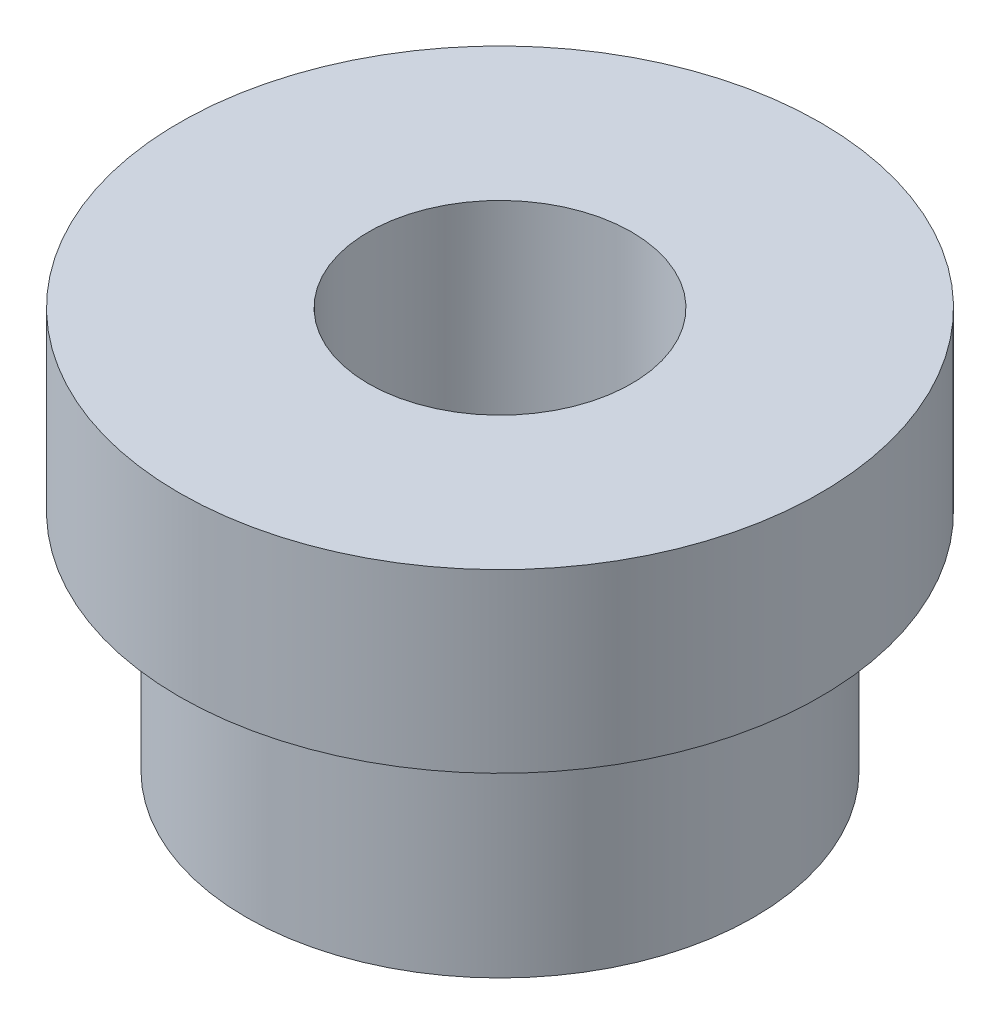
ISO-10303-21;
HEADER;
FILE_DESCRIPTION(('STEP AP214'),'2;1');
FILE_NAME('part.step','',(''),(''),'','','');
FILE_SCHEMA(('AUTOMOTIVE_DESIGN { 1 0 10303 214 1 1 1 1 }'));
ENDSEC;
DATA;
#1=APPLICATION_CONTEXT('core data for automotive mechanical design processes');
#2=APPLICATION_PROTOCOL_DEFINITION('international standard','automotive_design',2000,#1);
#3=PRODUCT_CONTEXT('',#1,'mechanical');
#4=PRODUCT('Part','Part','',(#3));
#5=PRODUCT_RELATED_PRODUCT_CATEGORY('part','',(#4));
#6=PRODUCT_DEFINITION_FORMATION('','',#4);
#7=PRODUCT_DEFINITION_CONTEXT('part definition',#1,'design');
#8=PRODUCT_DEFINITION('design','',#6,#7);
#9=PRODUCT_DEFINITION_SHAPE('','',#8);
#10=(LENGTH_UNIT() NAMED_UNIT(*) SI_UNIT(.MILLI.,.METRE.));
#11=(NAMED_UNIT(*) PLANE_ANGLE_UNIT() SI_UNIT($,.RADIAN.));
#12=(NAMED_UNIT(*) SI_UNIT($,.STERADIAN.) SOLID_ANGLE_UNIT());
#13=UNCERTAINTY_MEASURE_WITH_UNIT(LENGTH_MEASURE(1.E-05),#10,'distance_accuracy_value','');
#14=(GEOMETRIC_REPRESENTATION_CONTEXT(3) GLOBAL_UNCERTAINTY_ASSIGNED_CONTEXT((#13)) GLOBAL_UNIT_ASSIGNED_CONTEXT((#10,
#11,#12)) REPRESENTATION_CONTEXT('',''));
#15=CARTESIAN_POINT('',(0.,0.,0.));
#16=DIRECTION('',(0.,0.,1.));
#17=DIRECTION('',(1.,0.,0.));
#18=AXIS2_PLACEMENT_3D('',#15,#16,#17);
#19=CARTESIAN_POINT('',(0.,19.05,0.));
#20=DIRECTION('',(0.,-1.,0.));
#21=DIRECTION('',(0.,0.,-1.));
#22=AXIS2_PLACEMENT_3D('',#19,#20,#21);
#23=PLANE('',#22);
#24=CARTESIAN_POINT('',(0.,19.05,0.));
#25=DIRECTION('',(0.,1.,0.));
#26=DIRECTION('',(0.,0.,1.));
#27=AXIS2_PLACEMENT_3D('',#24,#25,#26);
#28=CIRCLE('',#27,6.24999999999999);
#29=CARTESIAN_POINT('',(0.,19.05,6.24999999999999));
#30=VERTEX_POINT('',#29);
#31=EDGE_CURVE('E58',#30,#30,#28,.T.);
#32=ORIENTED_EDGE('',*,*,#31,.F.);
#33=EDGE_LOOP('',(#32));
#34=FACE_BOUND('',#33,.T.);
#35=CARTESIAN_POINT('',(0.,19.05,0.));
#36=DIRECTION('',(0.,-1.,0.));
#37=DIRECTION('',(0.,0.,-1.));
#38=AXIS2_PLACEMENT_3D('',#35,#36,#37);
#39=CIRCLE('',#38,15.24);
#40=CARTESIAN_POINT('',(0.,19.05,-15.24));
#41=VERTEX_POINT('',#40);
#42=EDGE_CURVE('E50',#41,#41,#39,.T.);
#43=ORIENTED_EDGE('',*,*,#42,.F.);
#44=EDGE_LOOP('',(#43));
#45=FACE_BOUND('',#44,.T.);
#46=ADVANCED_FACE('F36',(#34,#45),#23,.F.);
#47=CARTESIAN_POINT('',(0.,0.,0.));
#48=DIRECTION('',(0.,-1.,0.));
#49=DIRECTION('',(0.,0.,-1.));
#50=AXIS2_PLACEMENT_3D('',#47,#48,#49);
#51=PLANE('',#50);
#52=CARTESIAN_POINT('',(0.,0.,0.));
#53=DIRECTION('',(0.,1.,0.));
#54=DIRECTION('',(0.,0.,1.));
#55=AXIS2_PLACEMENT_3D('',#52,#53,#54);
#56=CIRCLE('',#55,6.25);
#57=CARTESIAN_POINT('',(0.,0.,6.25));
#58=VERTEX_POINT('',#57);
#59=EDGE_CURVE('E55',#58,#58,#56,.T.);
#60=ORIENTED_EDGE('',*,*,#59,.T.);
#61=EDGE_LOOP('',(#60));
#62=FACE_BOUND('',#61,.T.);
#63=CARTESIAN_POINT('',(0.,0.,0.));
#64=DIRECTION('',(0.,-1.,0.));
#65=DIRECTION('',(0.,0.,-1.));
#66=AXIS2_PLACEMENT_3D('',#63,#64,#65);
#67=CIRCLE('',#66,12.065);
#68=CARTESIAN_POINT('',(0.,0.,-12.065));
#69=VERTEX_POINT('',#68);
#70=EDGE_CURVE('E10',#69,#69,#67,.T.);
#71=ORIENTED_EDGE('',*,*,#70,.T.);
#72=EDGE_LOOP('',(#71));
#73=FACE_BOUND('',#72,.T.);
#74=ADVANCED_FACE('F66',(#62,#73),#51,.T.);
#75=CARTESIAN_POINT('',(0.,17.78,0.));
#76=DIRECTION('',(0.,-1.,0.));
#77=DIRECTION('',(0.,0.,-1.));
#78=AXIS2_PLACEMENT_3D('',#75,#76,#77);
#79=CYLINDRICAL_SURFACE('',#78,12.065);
#80=CARTESIAN_POINT('',(0.,10.668,0.));
#81=DIRECTION('',(0.,-1.,0.));
#82=DIRECTION('',(0.,0.,-1.));
#83=AXIS2_PLACEMENT_3D('',#80,#81,#82);
#84=CIRCLE('',#83,12.065);
#85=CARTESIAN_POINT('',(0.,10.668,-12.065));
#86=VERTEX_POINT('',#85);
#87=EDGE_CURVE('E42',#86,#86,#84,.T.);
#88=ORIENTED_EDGE('',*,*,#87,.T.);
#89=EDGE_LOOP('',(#88));
#90=FACE_BOUND('',#89,.T.);
#91=ORIENTED_EDGE('',*,*,#70,.F.);
#92=EDGE_LOOP('',(#91));
#93=FACE_BOUND('',#92,.T.);
#94=ADVANCED_FACE('F78',(#90,#93),#79,.T.);
#95=CARTESIAN_POINT('',(0.,10.668,0.));
#96=DIRECTION('',(0.,-1.,0.));
#97=DIRECTION('',(0.,0.,-1.));
#98=AXIS2_PLACEMENT_3D('',#95,#96,#97);
#99=PLANE('',#98);
#100=CARTESIAN_POINT('',(0.,10.668,0.));
#101=DIRECTION('',(0.,-1.,0.));
#102=DIRECTION('',(0.,0.,-1.));
#103=AXIS2_PLACEMENT_3D('',#100,#101,#102);
#104=CIRCLE('',#103,15.24);
#105=CARTESIAN_POINT('',(0.,10.668,-15.24));
#106=VERTEX_POINT('',#105);
#107=EDGE_CURVE('E46',#106,#106,#104,.T.);
#108=ORIENTED_EDGE('',*,*,#107,.T.);
#109=EDGE_LOOP('',(#108));
#110=FACE_BOUND('',#109,.T.);
#111=ORIENTED_EDGE('',*,*,#87,.F.);
#112=EDGE_LOOP('',(#111));
#113=FACE_BOUND('',#112,.T.);
#114=ADVANCED_FACE('F72',(#110,#113),#99,.T.);
#115=CARTESIAN_POINT('',(0.,17.78,0.));
#116=DIRECTION('',(0.,-1.,0.));
#117=DIRECTION('',(0.,0.,-1.));
#118=AXIS2_PLACEMENT_3D('',#115,#116,#117);
#119=CYLINDRICAL_SURFACE('',#118,15.24);
#120=ORIENTED_EDGE('',*,*,#42,.T.);
#121=EDGE_LOOP('',(#120));
#122=FACE_BOUND('',#121,.T.);
#123=ORIENTED_EDGE('',*,*,#107,.F.);
#124=EDGE_LOOP('',(#123));
#125=FACE_BOUND('',#124,.T.);
#126=ADVANCED_FACE('F69',(#122,#125),#119,.T.);
#127=CARTESIAN_POINT('',(0.,19.05,0.));
#128=DIRECTION('',(0.,1.,0.));
#129=DIRECTION('',(0.,0.,1.));
#130=AXIS2_PLACEMENT_3D('',#127,#128,#129);
#131=CYLINDRICAL_SURFACE('',#130,6.24999999999999);
#132=ORIENTED_EDGE('',*,*,#59,.F.);
#133=EDGE_LOOP('',(#132));
#134=FACE_BOUND('',#133,.T.);
#135=ORIENTED_EDGE('',*,*,#31,.T.);
#136=EDGE_LOOP('',(#135));
#137=FACE_BOUND('',#136,.T.);
#138=ADVANCED_FACE('F62',(#134,#137),#131,.F.);
#139=CLOSED_SHELL('',(#46,#74,#94,#114,#126,#138));
#140=MANIFOLD_SOLID_BREP('B2',#139);
#141=ADVANCED_BREP_SHAPE_REPRESENTATION('',(#18,#140),#14);
#142=SHAPE_DEFINITION_REPRESENTATION(#9,#141);
ENDSEC;
END-ISO-10303-21;
